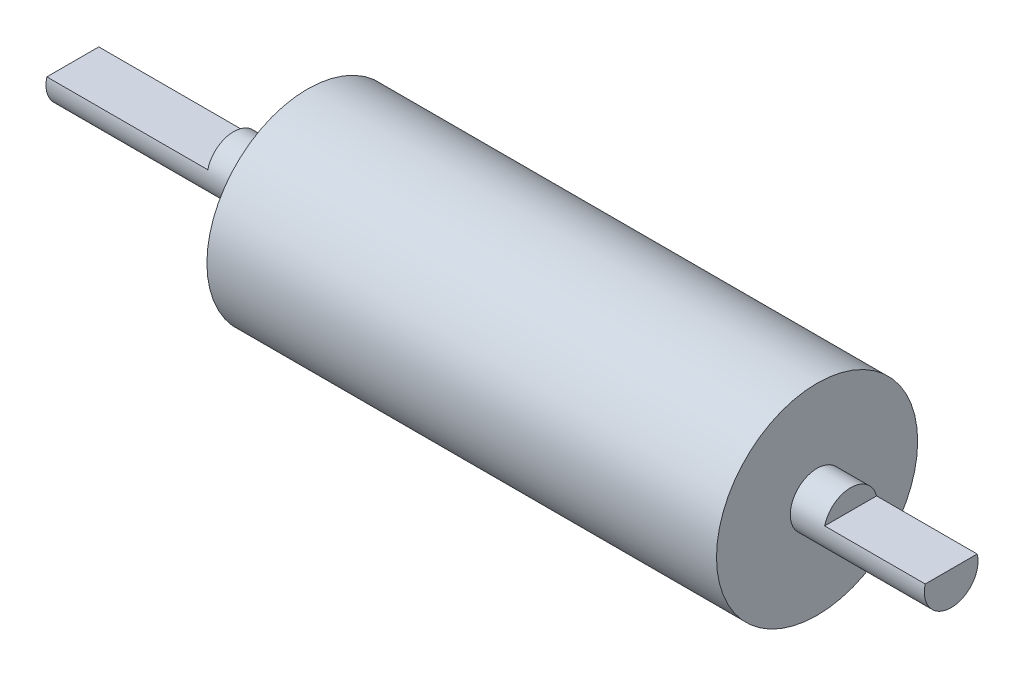
ISO-10303-21;
HEADER;
FILE_DESCRIPTION(('STEP AP214'),'2;1');
FILE_NAME('part.step','',(''),(''),'','','');
FILE_SCHEMA(('AUTOMOTIVE_DESIGN { 1 0 10303 214 1 1 1 1 }'));
ENDSEC;
DATA;
#1=APPLICATION_CONTEXT('core data for automotive mechanical design processes');
#2=APPLICATION_PROTOCOL_DEFINITION('international standard','automotive_design',2000,#1);
#3=PRODUCT_CONTEXT('',#1,'mechanical');
#4=PRODUCT('Part','Part','',(#3));
#5=PRODUCT_RELATED_PRODUCT_CATEGORY('part','',(#4));
#6=PRODUCT_DEFINITION_FORMATION('','',#4);
#7=PRODUCT_DEFINITION_CONTEXT('part definition',#1,'design');
#8=PRODUCT_DEFINITION('design','',#6,#7);
#9=PRODUCT_DEFINITION_SHAPE('','',#8);
#10=(LENGTH_UNIT() NAMED_UNIT(*) SI_UNIT(.MILLI.,.METRE.));
#11=(NAMED_UNIT(*) PLANE_ANGLE_UNIT() SI_UNIT($,.RADIAN.));
#12=(NAMED_UNIT(*) SI_UNIT($,.STERADIAN.) SOLID_ANGLE_UNIT());
#13=UNCERTAINTY_MEASURE_WITH_UNIT(LENGTH_MEASURE(1.E-05),#10,'distance_accuracy_value','');
#14=(GEOMETRIC_REPRESENTATION_CONTEXT(3) GLOBAL_UNCERTAINTY_ASSIGNED_CONTEXT((#13)) GLOBAL_UNIT_ASSIGNED_CONTEXT((#10,
#11,#12)) REPRESENTATION_CONTEXT('',''));
#15=CARTESIAN_POINT('',(0.,0.,0.));
#16=DIRECTION('',(0.,0.,1.));
#17=DIRECTION('',(1.,0.,0.));
#18=AXIS2_PLACEMENT_3D('',#15,#16,#17);
#19=CARTESIAN_POINT('',(35.,0.,0.));
#20=DIRECTION('',(-1.,0.,0.));
#21=DIRECTION('',(0.,0.,1.));
#22=AXIS2_PLACEMENT_3D('',#19,#20,#21);
#23=CYLINDRICAL_SURFACE('',#22,4.);
#24=CARTESIAN_POINT('',(35.,0.,0.));
#25=DIRECTION('',(1.,0.,0.));
#26=DIRECTION('',(0.,0.,-1.));
#27=AXIS2_PLACEMENT_3D('',#24,#25,#26);
#28=CIRCLE('',#27,4.);
#29=CARTESIAN_POINT('',(35.,0.,-4.));
#30=VERTEX_POINT('',#29);
#31=EDGE_CURVE('E105',#30,#30,#28,.T.);
#32=ORIENTED_EDGE('',*,*,#31,.F.);
#33=EDGE_LOOP('',(#32));
#34=FACE_BOUND('',#33,.T.);
#35=CARTESIAN_POINT('',(24.,0.,0.));
#36=DIRECTION('',(-1.,0.,0.));
#37=DIRECTION('',(0.,0.,1.));
#38=AXIS2_PLACEMENT_3D('',#35,#36,#37);
#39=CIRCLE('',#38,4.);
#40=CARTESIAN_POINT('',(24.,1.,3.87298334620742));
#41=VERTEX_POINT('',#40);
#42=CARTESIAN_POINT('',(24.,1.,-3.87298334620742));
#43=VERTEX_POINT('',#42);
#44=EDGE_CURVE('E83',#41,#43,#39,.T.);
#45=ORIENTED_EDGE('',*,*,#44,.F.);
#46=DIRECTION('',(-1.,0.,0.));
#47=VECTOR('',#46,1.);
#48=CARTESIAN_POINT('',(35.,1.,3.87298334620742));
#49=LINE('',#48,#47);
#50=CARTESIAN_POINT('',(0.,1.,3.87298334620742));
#51=VERTEX_POINT('',#50);
#52=EDGE_CURVE('E92',#41,#51,#49,.T.);
#53=ORIENTED_EDGE('',*,*,#52,.T.);
#54=CARTESIAN_POINT('',(0.,0.,0.));
#55=DIRECTION('',(1.,0.,0.));
#56=DIRECTION('',(0.,0.,-1.));
#57=AXIS2_PLACEMENT_3D('',#54,#55,#56);
#58=CIRCLE('',#57,4.);
#59=CARTESIAN_POINT('',(0.,1.,-3.87298334620742));
#60=VERTEX_POINT('',#59);
#61=EDGE_CURVE('E107',#51,#60,#58,.T.);
#62=ORIENTED_EDGE('',*,*,#61,.T.);
#63=DIRECTION('',(-1.,0.,0.));
#64=VECTOR('',#63,1.);
#65=CARTESIAN_POINT('',(35.,1.,-3.87298334620742));
#66=LINE('',#65,#64);
#67=EDGE_CURVE('E59',#60,#43,#66,.F.);
#68=ORIENTED_EDGE('',*,*,#67,.T.);
#69=EDGE_LOOP('',(#45,#53,#62,#68));
#70=FACE_BOUND('',#69,.T.);
#71=ADVANCED_FACE('F37',(#34,#70),#23,.T.);
#72=CARTESIAN_POINT('',(0.,0.,0.));
#73=DIRECTION('',(1.,0.,0.));
#74=DIRECTION('',(0.,0.,-1.));
#75=AXIS2_PLACEMENT_3D('',#72,#73,#74);
#76=PLANE('',#75);
#77=ORIENTED_EDGE('',*,*,#61,.F.);
#78=DIRECTION('',(0.,0.,-1.));
#79=VECTOR('',#78,1.);
#80=CARTESIAN_POINT('',(0.,1.,0.));
#81=LINE('',#80,#79);
#82=EDGE_CURVE('E104',#51,#60,#81,.T.);
#83=ORIENTED_EDGE('',*,*,#82,.T.);
#84=EDGE_LOOP('',(#77,#83));
#85=FACE_BOUND('',#84,.T.);
#86=ADVANCED_FACE('F136',(#85),#76,.F.);
#87=CARTESIAN_POINT('',(111.,0.,0.));
#88=DIRECTION('',(-1.,0.,0.));
#89=DIRECTION('',(0.,0.,1.));
#90=AXIS2_PLACEMENT_3D('',#87,#88,#89);
#91=CYLINDRICAL_SURFACE('',#90,15.);
#92=CARTESIAN_POINT('',(111.,0.,0.));
#93=DIRECTION('',(1.,0.,0.));
#94=DIRECTION('',(0.,0.,-1.));
#95=AXIS2_PLACEMENT_3D('',#92,#93,#94);
#96=CIRCLE('',#95,15.);
#97=CARTESIAN_POINT('',(111.,0.,-15.));
#98=VERTEX_POINT('',#97);
#99=EDGE_CURVE('E95',#98,#98,#96,.T.);
#100=ORIENTED_EDGE('',*,*,#99,.F.);
#101=EDGE_LOOP('',(#100));
#102=FACE_BOUND('',#101,.T.);
#103=CARTESIAN_POINT('',(35.,0.,0.));
#104=DIRECTION('',(1.,0.,0.));
#105=DIRECTION('',(0.,0.,-1.));
#106=AXIS2_PLACEMENT_3D('',#103,#104,#105);
#107=CIRCLE('',#106,15.);
#108=CARTESIAN_POINT('',(35.,0.,-15.));
#109=VERTEX_POINT('',#108);
#110=EDGE_CURVE('E91',#109,#109,#107,.T.);
#111=ORIENTED_EDGE('',*,*,#110,.T.);
#112=EDGE_LOOP('',(#111));
#113=FACE_BOUND('',#112,.T.);
#114=ADVANCED_FACE('F141',(#102,#113),#91,.T.);
#115=CARTESIAN_POINT('',(111.,0.,0.));
#116=DIRECTION('',(1.,0.,0.));
#117=DIRECTION('',(0.,0.,-1.));
#118=AXIS2_PLACEMENT_3D('',#115,#116,#117);
#119=PLANE('',#118);
#120=CARTESIAN_POINT('',(111.,0.,0.));
#121=DIRECTION('',(1.,0.,0.));
#122=DIRECTION('',(0.,0.,-1.));
#123=AXIS2_PLACEMENT_3D('',#120,#121,#122);
#124=CIRCLE('',#123,4.);
#125=CARTESIAN_POINT('',(111.,0.,-4.));
#126=VERTEX_POINT('',#125);
#127=EDGE_CURVE('E101',#126,#126,#124,.T.);
#128=ORIENTED_EDGE('',*,*,#127,.F.);
#129=EDGE_LOOP('',(#128));
#130=FACE_BOUND('',#129,.T.);
#131=ORIENTED_EDGE('',*,*,#99,.T.);
#132=EDGE_LOOP('',(#131));
#133=FACE_BOUND('',#132,.T.);
#134=ADVANCED_FACE('F148',(#130,#133),#119,.T.);
#135=CARTESIAN_POINT('',(35.,0.,0.));
#136=DIRECTION('',(1.,0.,0.));
#137=DIRECTION('',(0.,0.,-1.));
#138=AXIS2_PLACEMENT_3D('',#135,#136,#137);
#139=PLANE('',#138);
#140=ORIENTED_EDGE('',*,*,#31,.T.);
#141=EDGE_LOOP('',(#140));
#142=FACE_BOUND('',#141,.T.);
#143=ORIENTED_EDGE('',*,*,#110,.F.);
#144=EDGE_LOOP('',(#143));
#145=FACE_BOUND('',#144,.T.);
#146=ADVANCED_FACE('F145',(#142,#145),#139,.F.);
#147=CARTESIAN_POINT('',(131.,0.,0.));
#148=DIRECTION('',(-1.,0.,0.));
#149=DIRECTION('',(0.,0.,1.));
#150=AXIS2_PLACEMENT_3D('',#147,#148,#149);
#151=CYLINDRICAL_SURFACE('',#150,4.);
#152=CARTESIAN_POINT('',(131.,0.,0.));
#153=DIRECTION('',(1.,0.,0.));
#154=DIRECTION('',(0.,0.,-1.));
#155=AXIS2_PLACEMENT_3D('',#152,#153,#154);
#156=CIRCLE('',#155,4.);
#157=CARTESIAN_POINT('',(131.,1.,3.87298334620742));
#158=VERTEX_POINT('',#157);
#159=CARTESIAN_POINT('',(131.,1.,-3.87298334620742));
#160=VERTEX_POINT('',#159);
#161=EDGE_CURVE('E87',#158,#160,#156,.T.);
#162=ORIENTED_EDGE('',*,*,#161,.F.);
#163=DIRECTION('',(-1.,0.,0.));
#164=VECTOR('',#163,1.);
#165=CARTESIAN_POINT('',(131.,1.,3.87298334620742));
#166=LINE('',#165,#164);
#167=CARTESIAN_POINT('',(116.,1.,3.87298334620742));
#168=VERTEX_POINT('',#167);
#169=EDGE_CURVE('E51',#158,#168,#166,.T.);
#170=ORIENTED_EDGE('',*,*,#169,.T.);
#171=CARTESIAN_POINT('',(116.,0.,0.));
#172=DIRECTION('',(1.,0.,0.));
#173=DIRECTION('',(0.,0.,-1.));
#174=AXIS2_PLACEMENT_3D('',#171,#172,#173);
#175=CIRCLE('',#174,4.);
#176=CARTESIAN_POINT('',(116.,1.,-3.87298334620742));
#177=VERTEX_POINT('',#176);
#178=EDGE_CURVE('E11',#177,#168,#175,.T.);
#179=ORIENTED_EDGE('',*,*,#178,.F.);
#180=DIRECTION('',(-1.,0.,0.));
#181=VECTOR('',#180,1.);
#182=CARTESIAN_POINT('',(131.,1.,-3.87298334620742));
#183=LINE('',#182,#181);
#184=EDGE_CURVE('E78',#177,#160,#183,.F.);
#185=ORIENTED_EDGE('',*,*,#184,.T.);
#186=EDGE_LOOP('',(#162,#170,#179,#185));
#187=FACE_BOUND('',#186,.T.);
#188=ORIENTED_EDGE('',*,*,#127,.T.);
#189=EDGE_LOOP('',(#188));
#190=FACE_BOUND('',#189,.T.);
#191=ADVANCED_FACE('F85',(#187,#190),#151,.T.);
#192=CARTESIAN_POINT('',(131.,0.,0.));
#193=DIRECTION('',(1.,0.,0.));
#194=DIRECTION('',(0.,0.,-1.));
#195=AXIS2_PLACEMENT_3D('',#192,#193,#194);
#196=PLANE('',#195);
#197=DIRECTION('',(0.,0.,-1.));
#198=VECTOR('',#197,1.);
#199=CARTESIAN_POINT('',(131.,1.,0.));
#200=LINE('',#199,#198);
#201=EDGE_CURVE('E44',#158,#160,#200,.T.);
#202=ORIENTED_EDGE('',*,*,#201,.F.);
#203=ORIENTED_EDGE('',*,*,#161,.T.);
#204=EDGE_LOOP('',(#202,#203));
#205=FACE_BOUND('',#204,.T.);
#206=ADVANCED_FACE('F90',(#205),#196,.T.);
#207=CARTESIAN_POINT('',(24.,0.,0.));
#208=DIRECTION('',(-1.,0.,0.));
#209=DIRECTION('',(0.,0.,1.));
#210=AXIS2_PLACEMENT_3D('',#207,#208,#209);
#211=PLANE('',#210);
#212=DIRECTION('',(0.,0.,1.));
#213=VECTOR('',#212,1.);
#214=CARTESIAN_POINT('',(24.,1.,-5.54397847825351));
#215=LINE('',#214,#213);
#216=EDGE_CURVE('E117',#43,#41,#215,.T.);
#217=ORIENTED_EDGE('',*,*,#216,.T.);
#218=ORIENTED_EDGE('',*,*,#44,.T.);
#219=EDGE_LOOP('',(#217,#218));
#220=FACE_BOUND('',#219,.T.);
#221=ADVANCED_FACE('F116',(#220),#211,.T.);
#222=CARTESIAN_POINT('',(24.,1.,-5.54397847825351));
#223=DIRECTION('',(0.,-1.,0.));
#224=DIRECTION('',(0.,0.,-1.));
#225=AXIS2_PLACEMENT_3D('',#222,#223,#224);
#226=PLANE('',#225);
#227=ORIENTED_EDGE('',*,*,#216,.F.);
#228=ORIENTED_EDGE('',*,*,#67,.F.);
#229=ORIENTED_EDGE('',*,*,#82,.F.);
#230=ORIENTED_EDGE('',*,*,#52,.F.);
#231=EDGE_LOOP('',(#227,#228,#229,#230));
#232=FACE_BOUND('',#231,.T.);
#233=ADVANCED_FACE('F120',(#232),#226,.F.);
#234=CARTESIAN_POINT('',(116.,0.,0.));
#235=DIRECTION('',(1.,0.,0.));
#236=DIRECTION('',(0.,0.,-1.));
#237=AXIS2_PLACEMENT_3D('',#234,#235,#236);
#238=PLANE('',#237);
#239=DIRECTION('',(0.,0.,-1.));
#240=VECTOR('',#239,1.);
#241=CARTESIAN_POINT('',(116.,1.,9.57279869752434));
#242=LINE('',#241,#240);
#243=EDGE_CURVE('E88',#168,#177,#242,.T.);
#244=ORIENTED_EDGE('',*,*,#243,.T.);
#245=ORIENTED_EDGE('',*,*,#178,.T.);
#246=EDGE_LOOP('',(#244,#245));
#247=FACE_BOUND('',#246,.T.);
#248=ADVANCED_FACE('F126',(#247),#238,.T.);
#249=CARTESIAN_POINT('',(116.,1.,9.57279869752434));
#250=DIRECTION('',(0.,-1.,0.));
#251=DIRECTION('',(0.,0.,-1.));
#252=AXIS2_PLACEMENT_3D('',#249,#250,#251);
#253=PLANE('',#252);
#254=ORIENTED_EDGE('',*,*,#201,.T.);
#255=ORIENTED_EDGE('',*,*,#184,.F.);
#256=ORIENTED_EDGE('',*,*,#243,.F.);
#257=ORIENTED_EDGE('',*,*,#169,.F.);
#258=EDGE_LOOP('',(#254,#255,#256,#257));
#259=FACE_BOUND('',#258,.T.);
#260=ADVANCED_FACE('F77',(#259),#253,.F.);
#261=CLOSED_SHELL('',(#71,#86,#114,#134,#146,#191,#206,#221,#233,#248,#260));
#262=MANIFOLD_SOLID_BREP('B2',#261);
#263=ADVANCED_BREP_SHAPE_REPRESENTATION('',(#18,#262),#14);
#264=SHAPE_DEFINITION_REPRESENTATION(#9,#263);
ENDSEC;
END-ISO-10303-21;
